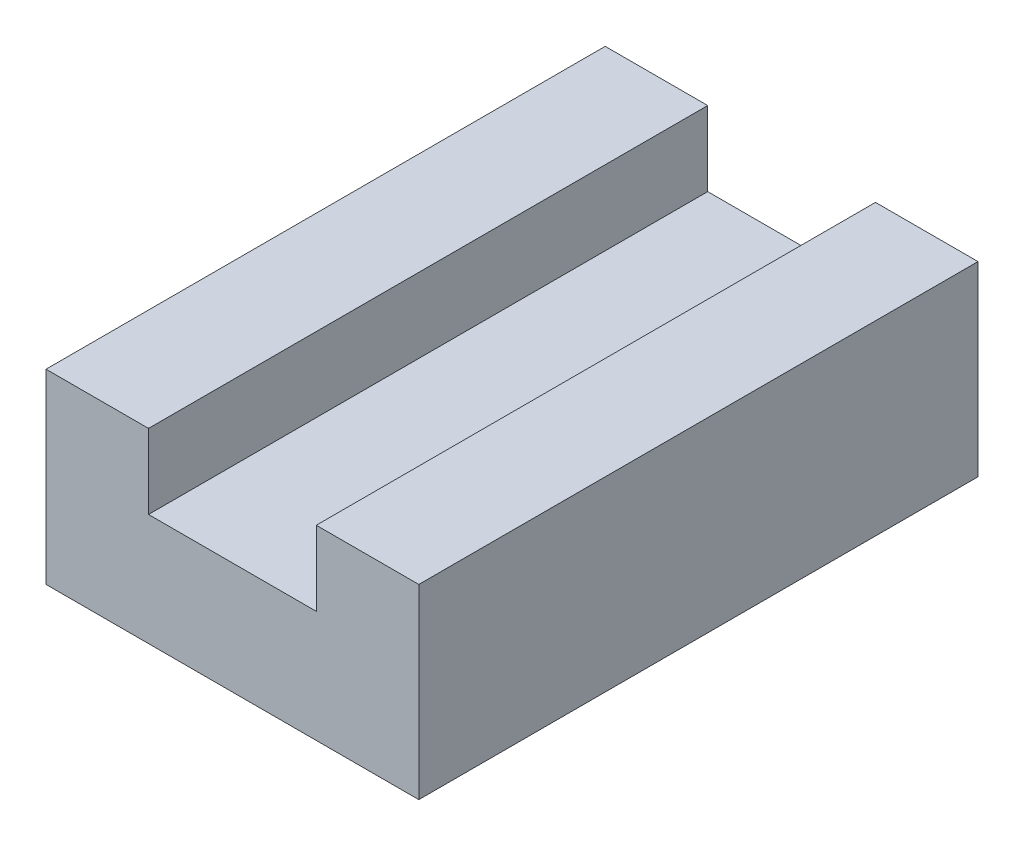
ISO-10303-21;
HEADER;
FILE_DESCRIPTION(('STEP AP214'),'2;1');
FILE_NAME('part.step','',(''),(''),'','','');
FILE_SCHEMA(('AUTOMOTIVE_DESIGN { 1 0 10303 214 1 1 1 1 }'));
ENDSEC;
DATA;
#1=APPLICATION_CONTEXT('core data for automotive mechanical design processes');
#2=APPLICATION_PROTOCOL_DEFINITION('international standard','automotive_design',2000,#1);
#3=PRODUCT_CONTEXT('',#1,'mechanical');
#4=PRODUCT('Part','Part','',(#3));
#5=PRODUCT_RELATED_PRODUCT_CATEGORY('part','',(#4));
#6=PRODUCT_DEFINITION_FORMATION('','',#4);
#7=PRODUCT_DEFINITION_CONTEXT('part definition',#1,'design');
#8=PRODUCT_DEFINITION('design','',#6,#7);
#9=PRODUCT_DEFINITION_SHAPE('','',#8);
#10=(LENGTH_UNIT() NAMED_UNIT(*) SI_UNIT(.MILLI.,.METRE.));
#11=(NAMED_UNIT(*) PLANE_ANGLE_UNIT() SI_UNIT($,.RADIAN.));
#12=(NAMED_UNIT(*) SI_UNIT($,.STERADIAN.) SOLID_ANGLE_UNIT());
#13=UNCERTAINTY_MEASURE_WITH_UNIT(LENGTH_MEASURE(1.E-05),#10,'distance_accuracy_value','');
#14=(GEOMETRIC_REPRESENTATION_CONTEXT(3) GLOBAL_UNCERTAINTY_ASSIGNED_CONTEXT((#13)) GLOBAL_UNIT_ASSIGNED_CONTEXT((#10,
#11,#12)) REPRESENTATION_CONTEXT('',''));
#15=CARTESIAN_POINT('',(0.,0.,0.));
#16=DIRECTION('',(0.,0.,1.));
#17=DIRECTION('',(1.,0.,0.));
#18=AXIS2_PLACEMENT_3D('',#15,#16,#17);
#19=CARTESIAN_POINT('',(0.,10.,0.));
#20=DIRECTION('',(0.,-1.,0.));
#21=DIRECTION('',(0.,0.,-1.));
#22=AXIS2_PLACEMENT_3D('',#19,#20,#21);
#23=PLANE('',#22);
#24=DIRECTION('',(1.,0.,0.));
#25=VECTOR('',#24,1.);
#26=CARTESIAN_POINT('',(0.,10.,0.));
#27=LINE('',#26,#25);
#28=CARTESIAN_POINT('',(0.,10.,0.));
#29=VERTEX_POINT('',#28);
#30=CARTESIAN_POINT('',(5.5,10.,0.));
#31=VERTEX_POINT('',#30);
#32=EDGE_CURVE('E87',#29,#31,#27,.T.);
#33=ORIENTED_EDGE('',*,*,#32,.T.);
#34=DIRECTION('',(0.,0.,1.));
#35=VECTOR('',#34,1.);
#36=CARTESIAN_POINT('',(5.5,10.,-30.));
#37=LINE('',#36,#35);
#38=CARTESIAN_POINT('',(5.5,10.,-30.));
#39=VERTEX_POINT('',#38);
#40=EDGE_CURVE('E139',#39,#31,#37,.T.);
#41=ORIENTED_EDGE('',*,*,#40,.F.);
#42=DIRECTION('',(-1.,0.,0.));
#43=VECTOR('',#42,1.);
#44=CARTESIAN_POINT('',(0.,10.,-30.));
#45=LINE('',#44,#43);
#46=CARTESIAN_POINT('',(0.,10.,-30.));
#47=VERTEX_POINT('',#46);
#48=EDGE_CURVE('E58',#39,#47,#45,.T.);
#49=ORIENTED_EDGE('',*,*,#48,.T.);
#50=DIRECTION('',(0.,0.,1.));
#51=VECTOR('',#50,1.);
#52=CARTESIAN_POINT('',(0.,10.,0.));
#53=LINE('',#52,#51);
#54=EDGE_CURVE('E145',#47,#29,#53,.T.);
#55=ORIENTED_EDGE('',*,*,#54,.T.);
#56=EDGE_LOOP('',(#33,#41,#49,#55));
#57=FACE_BOUND('',#56,.T.);
#58=ADVANCED_FACE('F34',(#57),#23,.F.);
#59=CARTESIAN_POINT('',(0.,10.,0.));
#60=DIRECTION('',(1.,0.,0.));
#61=DIRECTION('',(0.,0.,-1.));
#62=AXIS2_PLACEMENT_3D('',#59,#60,#61);
#63=PLANE('',#62);
#64=DIRECTION('',(0.,0.,1.));
#65=VECTOR('',#64,1.);
#66=CARTESIAN_POINT('',(0.,0.,0.));
#67=LINE('',#66,#65);
#68=CARTESIAN_POINT('',(0.,0.,-30.));
#69=VERTEX_POINT('',#68);
#70=CARTESIAN_POINT('',(0.,0.,0.));
#71=VERTEX_POINT('',#70);
#72=EDGE_CURVE('E141',#69,#71,#67,.T.);
#73=ORIENTED_EDGE('',*,*,#72,.T.);
#74=DIRECTION('',(0.,-1.,0.));
#75=VECTOR('',#74,1.);
#76=CARTESIAN_POINT('',(0.,10.,0.));
#77=LINE('',#76,#75);
#78=EDGE_CURVE('E11',#29,#71,#77,.T.);
#79=ORIENTED_EDGE('',*,*,#78,.F.);
#80=ORIENTED_EDGE('',*,*,#54,.F.);
#81=DIRECTION('',(0.,-1.,0.));
#82=VECTOR('',#81,1.);
#83=CARTESIAN_POINT('',(0.,10.,-30.));
#84=LINE('',#83,#82);
#85=EDGE_CURVE('E154',#47,#69,#84,.T.);
#86=ORIENTED_EDGE('',*,*,#85,.T.);
#87=EDGE_LOOP('',(#73,#79,#80,#86));
#88=FACE_BOUND('',#87,.T.);
#89=ADVANCED_FACE('F36',(#88),#63,.F.);
#90=CARTESIAN_POINT('',(0.,10.,0.));
#91=DIRECTION('',(0.,0.,-1.));
#92=DIRECTION('',(-1.,0.,0.));
#93=AXIS2_PLACEMENT_3D('',#90,#91,#92);
#94=PLANE('',#93);
#95=DIRECTION('',(1.,0.,0.));
#96=VECTOR('',#95,1.);
#97=CARTESIAN_POINT('',(5.5,6.,0.));
#98=LINE('',#97,#96);
#99=CARTESIAN_POINT('',(5.5,6.,0.));
#100=VERTEX_POINT('',#99);
#101=CARTESIAN_POINT('',(14.5,6.,0.));
#102=VERTEX_POINT('',#101);
#103=EDGE_CURVE('E129',#100,#102,#98,.T.);
#104=ORIENTED_EDGE('',*,*,#103,.F.);
#105=DIRECTION('',(0.,-1.,0.));
#106=VECTOR('',#105,1.);
#107=CARTESIAN_POINT('',(5.5,10.,0.));
#108=LINE('',#107,#106);
#109=EDGE_CURVE('E114',#31,#100,#108,.T.);
#110=ORIENTED_EDGE('',*,*,#109,.F.);
#111=ORIENTED_EDGE('',*,*,#32,.F.);
#112=ORIENTED_EDGE('',*,*,#78,.T.);
#113=DIRECTION('',(1.,0.,0.));
#114=VECTOR('',#113,1.);
#115=CARTESIAN_POINT('',(0.,0.,0.));
#116=LINE('',#115,#114);
#117=CARTESIAN_POINT('',(20.,0.,0.));
#118=VERTEX_POINT('',#117);
#119=EDGE_CURVE('E157',#71,#118,#116,.T.);
#120=ORIENTED_EDGE('',*,*,#119,.T.);
#121=DIRECTION('',(0.,-1.,0.));
#122=VECTOR('',#121,1.);
#123=CARTESIAN_POINT('',(20.,10.,0.));
#124=LINE('',#123,#122);
#125=CARTESIAN_POINT('',(20.,10.,0.));
#126=VERTEX_POINT('',#125);
#127=EDGE_CURVE('E42',#126,#118,#124,.T.);
#128=ORIENTED_EDGE('',*,*,#127,.F.);
#129=CARTESIAN_POINT('',(14.5,10.,0.));
#130=VERTEX_POINT('',#129);
#131=EDGE_CURVE('E147',#130,#126,#27,.T.);
#132=ORIENTED_EDGE('',*,*,#131,.F.);
#133=DIRECTION('',(0.,1.,0.));
#134=VECTOR('',#133,1.);
#135=CARTESIAN_POINT('',(14.5,10.,0.));
#136=LINE('',#135,#134);
#137=EDGE_CURVE('E49',#102,#130,#136,.T.);
#138=ORIENTED_EDGE('',*,*,#137,.F.);
#139=EDGE_LOOP('',(#104,#110,#111,#112,#120,#128,#132,#138));
#140=FACE_BOUND('',#139,.T.);
#141=ADVANCED_FACE('F178',(#140),#94,.F.);
#142=CARTESIAN_POINT('',(20.,10.,0.));
#143=DIRECTION('',(-1.,0.,0.));
#144=DIRECTION('',(0.,0.,1.));
#145=AXIS2_PLACEMENT_3D('',#142,#143,#144);
#146=PLANE('',#145);
#147=DIRECTION('',(0.,0.,-1.));
#148=VECTOR('',#147,1.);
#149=CARTESIAN_POINT('',(20.,0.,0.));
#150=LINE('',#149,#148);
#151=CARTESIAN_POINT('',(20.,0.,-30.));
#152=VERTEX_POINT('',#151);
#153=EDGE_CURVE('E159',#118,#152,#150,.T.);
#154=ORIENTED_EDGE('',*,*,#153,.T.);
#155=DIRECTION('',(0.,-1.,0.));
#156=VECTOR('',#155,1.);
#157=CARTESIAN_POINT('',(20.,10.,-30.));
#158=LINE('',#157,#156);
#159=CARTESIAN_POINT('',(20.,10.,-30.));
#160=VERTEX_POINT('',#159);
#161=EDGE_CURVE('E163',#160,#152,#158,.T.);
#162=ORIENTED_EDGE('',*,*,#161,.F.);
#163=DIRECTION('',(0.,0.,-1.));
#164=VECTOR('',#163,1.);
#165=CARTESIAN_POINT('',(20.,10.,0.));
#166=LINE('',#165,#164);
#167=EDGE_CURVE('E149',#126,#160,#166,.T.);
#168=ORIENTED_EDGE('',*,*,#167,.F.);
#169=ORIENTED_EDGE('',*,*,#127,.T.);
#170=EDGE_LOOP('',(#154,#162,#168,#169));
#171=FACE_BOUND('',#170,.T.);
#172=ADVANCED_FACE('F169',(#171),#146,.F.);
#173=CARTESIAN_POINT('',(0.,10.,-30.));
#174=DIRECTION('',(0.,0.,1.));
#175=DIRECTION('',(1.,0.,0.));
#176=AXIS2_PLACEMENT_3D('',#173,#174,#175);
#177=PLANE('',#176);
#178=ORIENTED_EDGE('',*,*,#48,.F.);
#179=DIRECTION('',(0.,-1.,0.));
#180=VECTOR('',#179,1.);
#181=CARTESIAN_POINT('',(5.5,10.,-30.));
#182=LINE('',#181,#180);
#183=CARTESIAN_POINT('',(5.5,6.,-30.));
#184=VERTEX_POINT('',#183);
#185=EDGE_CURVE('E113',#39,#184,#182,.T.);
#186=ORIENTED_EDGE('',*,*,#185,.T.);
#187=DIRECTION('',(1.,0.,0.));
#188=VECTOR('',#187,1.);
#189=CARTESIAN_POINT('',(5.5,6.,-30.));
#190=LINE('',#189,#188);
#191=CARTESIAN_POINT('',(14.5,6.,-30.));
#192=VERTEX_POINT('',#191);
#193=EDGE_CURVE('E122',#184,#192,#190,.T.);
#194=ORIENTED_EDGE('',*,*,#193,.T.);
#195=DIRECTION('',(0.,1.,0.));
#196=VECTOR('',#195,1.);
#197=CARTESIAN_POINT('',(14.5,10.,-30.));
#198=LINE('',#197,#196);
#199=CARTESIAN_POINT('',(14.5,10.,-30.));
#200=VERTEX_POINT('',#199);
#201=EDGE_CURVE('E119',#192,#200,#198,.T.);
#202=ORIENTED_EDGE('',*,*,#201,.T.);
#203=EDGE_CURVE('E151',#160,#200,#45,.T.);
#204=ORIENTED_EDGE('',*,*,#203,.F.);
#205=ORIENTED_EDGE('',*,*,#161,.T.);
#206=DIRECTION('',(-1.,0.,0.));
#207=VECTOR('',#206,1.);
#208=CARTESIAN_POINT('',(0.,0.,-30.));
#209=LINE('',#208,#207);
#210=EDGE_CURVE('E80',#152,#69,#209,.T.);
#211=ORIENTED_EDGE('',*,*,#210,.T.);
#212=ORIENTED_EDGE('',*,*,#85,.F.);
#213=EDGE_LOOP('',(#178,#186,#194,#202,#204,#205,#211,#212));
#214=FACE_BOUND('',#213,.T.);
#215=ADVANCED_FACE('F127',(#214),#177,.F.);
#216=ORIENTED_EDGE('',*,*,#203,.T.);
#217=DIRECTION('',(0.,0.,1.));
#218=VECTOR('',#217,1.);
#219=CARTESIAN_POINT('',(14.5,10.,-30.));
#220=LINE('',#219,#218);
#221=EDGE_CURVE('E142',#200,#130,#220,.T.);
#222=ORIENTED_EDGE('',*,*,#221,.T.);
#223=ORIENTED_EDGE('',*,*,#131,.T.);
#224=ORIENTED_EDGE('',*,*,#167,.T.);
#225=EDGE_LOOP('',(#216,#222,#223,#224));
#226=FACE_BOUND('',#225,.T.);
#227=ADVANCED_FACE('F180',(#226),#23,.F.);
#228=CARTESIAN_POINT('',(0.,0.,0.));
#229=DIRECTION('',(0.,-1.,0.));
#230=DIRECTION('',(0.,0.,-1.));
#231=AXIS2_PLACEMENT_3D('',#228,#229,#230);
#232=PLANE('',#231);
#233=CARTESIAN_POINT('',(2.5,0.,-9.6821205827078));
#234=DIRECTION('',(0.,-1.,0.));
#235=DIRECTION('',(0.,0.,-1.));
#236=AXIS2_PLACEMENT_3D('',#233,#234,#235);
#237=CIRCLE('',#236,1.5);
#238=CARTESIAN_POINT('',(2.5,0.,-11.1821205827078));
#239=VERTEX_POINT('',#238);
#240=EDGE_CURVE('E332',#239,#239,#237,.T.);
#241=ORIENTED_EDGE('',*,*,#240,.F.);
#242=EDGE_LOOP('',(#241));
#243=FACE_BOUND('',#242,.T.);
#244=CARTESIAN_POINT('',(17.5,0.,-9.6821205827078));
#245=DIRECTION('',(0.,-1.,0.));
#246=DIRECTION('',(0.,0.,-1.));
#247=AXIS2_PLACEMENT_3D('',#244,#245,#246);
#248=CIRCLE('',#247,1.5);
#249=CARTESIAN_POINT('',(17.5,0.,-11.1821205827078));
#250=VERTEX_POINT('',#249);
#251=EDGE_CURVE('E331',#250,#250,#248,.T.);
#252=ORIENTED_EDGE('',*,*,#251,.F.);
#253=EDGE_LOOP('',(#252));
#254=FACE_BOUND('',#253,.T.);
#255=CARTESIAN_POINT('',(17.5,0.,-19.6821205827078));
#256=DIRECTION('',(0.,-1.,0.));
#257=DIRECTION('',(0.,0.,-1.));
#258=AXIS2_PLACEMENT_3D('',#255,#256,#257);
#259=CIRCLE('',#258,1.5);
#260=CARTESIAN_POINT('',(17.5,0.,-21.1821205827078));
#261=VERTEX_POINT('',#260);
#262=EDGE_CURVE('E347',#261,#261,#259,.T.);
#263=ORIENTED_EDGE('',*,*,#262,.F.);
#264=EDGE_LOOP('',(#263));
#265=FACE_BOUND('',#264,.T.);
#266=CARTESIAN_POINT('',(2.5,0.,-19.6821205827078));
#267=DIRECTION('',(0.,-1.,0.));
#268=DIRECTION('',(0.,0.,-1.));
#269=AXIS2_PLACEMENT_3D('',#266,#267,#268);
#270=CIRCLE('',#269,1.5);
#271=CARTESIAN_POINT('',(2.5,0.,-21.1821205827078));
#272=VERTEX_POINT('',#271);
#273=EDGE_CURVE('E132',#272,#272,#270,.T.);
#274=ORIENTED_EDGE('',*,*,#273,.F.);
#275=EDGE_LOOP('',(#274));
#276=FACE_BOUND('',#275,.T.);
#277=ORIENTED_EDGE('',*,*,#72,.F.);
#278=ORIENTED_EDGE('',*,*,#210,.F.);
#279=ORIENTED_EDGE('',*,*,#153,.F.);
#280=ORIENTED_EDGE('',*,*,#119,.F.);
#281=EDGE_LOOP('',(#277,#278,#279,#280));
#282=FACE_BOUND('',#281,.T.);
#283=ADVANCED_FACE('F174',(#243,#254,#265,#276,#282),#232,.T.);
#284=CARTESIAN_POINT('',(5.5,10.,-30.));
#285=DIRECTION('',(-1.,0.,0.));
#286=DIRECTION('',(0.,0.,1.));
#287=AXIS2_PLACEMENT_3D('',#284,#285,#286);
#288=PLANE('',#287);
#289=ORIENTED_EDGE('',*,*,#109,.T.);
#290=DIRECTION('',(0.,0.,1.));
#291=VECTOR('',#290,1.);
#292=CARTESIAN_POINT('',(5.5,6.,-30.));
#293=LINE('',#292,#291);
#294=EDGE_CURVE('E109',#184,#100,#293,.T.);
#295=ORIENTED_EDGE('',*,*,#294,.F.);
#296=ORIENTED_EDGE('',*,*,#185,.F.);
#297=ORIENTED_EDGE('',*,*,#40,.T.);
#298=EDGE_LOOP('',(#289,#295,#296,#297));
#299=FACE_BOUND('',#298,.T.);
#300=ADVANCED_FACE('F111',(#299),#288,.F.);
#301=CARTESIAN_POINT('',(14.5,10.,-30.));
#302=DIRECTION('',(1.,0.,0.));
#303=DIRECTION('',(0.,1.,0.));
#304=AXIS2_PLACEMENT_3D('',#301,#302,#303);
#305=PLANE('',#304);
#306=ORIENTED_EDGE('',*,*,#137,.T.);
#307=ORIENTED_EDGE('',*,*,#221,.F.);
#308=ORIENTED_EDGE('',*,*,#201,.F.);
#309=DIRECTION('',(0.,0.,1.));
#310=VECTOR('',#309,1.);
#311=CARTESIAN_POINT('',(14.5,6.,-30.));
#312=LINE('',#311,#310);
#313=EDGE_CURVE('E118',#192,#102,#312,.T.);
#314=ORIENTED_EDGE('',*,*,#313,.T.);
#315=EDGE_LOOP('',(#306,#307,#308,#314));
#316=FACE_BOUND('',#315,.T.);
#317=ADVANCED_FACE('F182',(#316),#305,.F.);
#318=CARTESIAN_POINT('',(5.5,6.,-30.));
#319=DIRECTION('',(0.,-1.,0.));
#320=DIRECTION('',(1.,0.,0.));
#321=AXIS2_PLACEMENT_3D('',#318,#319,#320);
#322=PLANE('',#321);
#323=ORIENTED_EDGE('',*,*,#103,.T.);
#324=ORIENTED_EDGE('',*,*,#313,.F.);
#325=ORIENTED_EDGE('',*,*,#193,.F.);
#326=ORIENTED_EDGE('',*,*,#294,.T.);
#327=EDGE_LOOP('',(#323,#324,#325,#326));
#328=FACE_BOUND('',#327,.T.);
#329=ADVANCED_FACE('F123',(#328),#322,.F.);
#330=CARTESIAN_POINT('',(2.5,5.,-19.6821205827078));
#331=DIRECTION('',(0.,-1.,0.));
#332=DIRECTION('',(0.,0.,-1.));
#333=AXIS2_PLACEMENT_3D('',#330,#331,#332);
#334=CYLINDRICAL_SURFACE('',#333,1.5);
#335=CARTESIAN_POINT('',(2.5,5.,-19.6821205827078));
#336=DIRECTION('',(0.,-1.,0.));
#337=DIRECTION('',(0.,0.,-1.));
#338=AXIS2_PLACEMENT_3D('',#335,#336,#337);
#339=CIRCLE('',#338,1.5);
#340=CARTESIAN_POINT('',(2.5,5.,-21.1821205827078));
#341=VERTEX_POINT('',#340);
#342=EDGE_CURVE('E137',#341,#341,#339,.T.);
#343=ORIENTED_EDGE('',*,*,#342,.F.);
#344=EDGE_LOOP('',(#343));
#345=FACE_BOUND('',#344,.T.);
#346=ORIENTED_EDGE('',*,*,#273,.T.);
#347=EDGE_LOOP('',(#346));
#348=FACE_BOUND('',#347,.T.);
#349=ADVANCED_FACE('F189',(#345,#348),#334,.F.);
#350=CARTESIAN_POINT('',(2.5,5.,-19.6821205827078));
#351=DIRECTION('',(0.,-1.,0.));
#352=DIRECTION('',(0.,0.,-1.));
#353=AXIS2_PLACEMENT_3D('',#350,#351,#352);
#354=PLANE('',#353);
#355=ORIENTED_EDGE('',*,*,#342,.T.);
#356=EDGE_LOOP('',(#355));
#357=FACE_BOUND('',#356,.T.);
#358=ADVANCED_FACE('F255',(#357),#354,.T.);
#359=CARTESIAN_POINT('',(17.5,5.,-19.6821205827078));
#360=DIRECTION('',(0.,-1.,0.));
#361=DIRECTION('',(0.,0.,-1.));
#362=AXIS2_PLACEMENT_3D('',#359,#360,#361);
#363=CYLINDRICAL_SURFACE('',#362,1.5);
#364=CARTESIAN_POINT('',(17.5,5.,-19.6821205827078));
#365=DIRECTION('',(0.,-1.,0.));
#366=DIRECTION('',(0.,0.,-1.));
#367=AXIS2_PLACEMENT_3D('',#364,#365,#366);
#368=CIRCLE('',#367,1.5);
#369=CARTESIAN_POINT('',(17.5,5.,-21.1821205827078));
#370=VERTEX_POINT('',#369);
#371=EDGE_CURVE('E343',#370,#370,#368,.T.);
#372=ORIENTED_EDGE('',*,*,#371,.F.);
#373=EDGE_LOOP('',(#372));
#374=FACE_BOUND('',#373,.T.);
#375=ORIENTED_EDGE('',*,*,#262,.T.);
#376=EDGE_LOOP('',(#375));
#377=FACE_BOUND('',#376,.T.);
#378=ADVANCED_FACE('F263',(#374,#377),#363,.F.);
#379=CARTESIAN_POINT('',(17.5,5.,-19.6821205827078));
#380=DIRECTION('',(0.,-1.,0.));
#381=DIRECTION('',(0.,0.,-1.));
#382=AXIS2_PLACEMENT_3D('',#379,#380,#381);
#383=PLANE('',#382);
#384=ORIENTED_EDGE('',*,*,#371,.T.);
#385=EDGE_LOOP('',(#384));
#386=FACE_BOUND('',#385,.T.);
#387=ADVANCED_FACE('F272',(#386),#383,.T.);
#388=CARTESIAN_POINT('',(17.5,5.,-9.6821205827078));
#389=DIRECTION('',(0.,-1.,0.));
#390=DIRECTION('',(0.,0.,-1.));
#391=AXIS2_PLACEMENT_3D('',#388,#389,#390);
#392=CYLINDRICAL_SURFACE('',#391,1.5);
#393=CARTESIAN_POINT('',(17.5,5.,-9.6821205827078));
#394=DIRECTION('',(0.,-1.,0.));
#395=DIRECTION('',(0.,0.,-1.));
#396=AXIS2_PLACEMENT_3D('',#393,#394,#395);
#397=CIRCLE('',#396,1.5);
#398=CARTESIAN_POINT('',(17.5,5.,-11.1821205827078));
#399=VERTEX_POINT('',#398);
#400=EDGE_CURVE('E335',#399,#399,#397,.T.);
#401=ORIENTED_EDGE('',*,*,#400,.F.);
#402=EDGE_LOOP('',(#401));
#403=FACE_BOUND('',#402,.T.);
#404=ORIENTED_EDGE('',*,*,#251,.T.);
#405=EDGE_LOOP('',(#404));
#406=FACE_BOUND('',#405,.T.);
#407=ADVANCED_FACE('F281',(#403,#406),#392,.F.);
#408=CARTESIAN_POINT('',(17.5,5.,-9.6821205827078));
#409=DIRECTION('',(0.,-1.,0.));
#410=DIRECTION('',(0.,0.,-1.));
#411=AXIS2_PLACEMENT_3D('',#408,#409,#410);
#412=PLANE('',#411);
#413=ORIENTED_EDGE('',*,*,#400,.T.);
#414=EDGE_LOOP('',(#413));
#415=FACE_BOUND('',#414,.T.);
#416=ADVANCED_FACE('F290',(#415),#412,.T.);
#417=CARTESIAN_POINT('',(2.5,5.,-9.6821205827078));
#418=DIRECTION('',(0.,-1.,0.));
#419=DIRECTION('',(0.,0.,-1.));
#420=AXIS2_PLACEMENT_3D('',#417,#418,#419);
#421=CYLINDRICAL_SURFACE('',#420,1.5);
#422=CARTESIAN_POINT('',(2.5,5.,-9.6821205827078));
#423=DIRECTION('',(0.,-1.,0.));
#424=DIRECTION('',(0.,0.,-1.));
#425=AXIS2_PLACEMENT_3D('',#422,#423,#424);
#426=CIRCLE('',#425,1.5);
#427=CARTESIAN_POINT('',(2.5,5.,-11.1821205827078));
#428=VERTEX_POINT('',#427);
#429=EDGE_CURVE('E330',#428,#428,#426,.T.);
#430=ORIENTED_EDGE('',*,*,#429,.F.);
#431=EDGE_LOOP('',(#430));
#432=FACE_BOUND('',#431,.T.);
#433=ORIENTED_EDGE('',*,*,#240,.T.);
#434=EDGE_LOOP('',(#433));
#435=FACE_BOUND('',#434,.T.);
#436=ADVANCED_FACE('F299',(#432,#435),#421,.F.);
#437=CARTESIAN_POINT('',(2.5,5.,-9.6821205827078));
#438=DIRECTION('',(0.,-1.,0.));
#439=DIRECTION('',(0.,0.,-1.));
#440=AXIS2_PLACEMENT_3D('',#437,#438,#439);
#441=PLANE('',#440);
#442=ORIENTED_EDGE('',*,*,#429,.T.);
#443=EDGE_LOOP('',(#442));
#444=FACE_BOUND('',#443,.T.);
#445=ADVANCED_FACE('F308',(#444),#441,.T.);
#446=CLOSED_SHELL('',(#58,#89,#141,#172,#215,#227,#283,#300,#317,#329,#349,#358,#378,#387,#407,
#416,#436,#445));
#447=MANIFOLD_SOLID_BREP('B2',#446);
#448=ADVANCED_BREP_SHAPE_REPRESENTATION('',(#18,#447),#14);
#449=SHAPE_DEFINITION_REPRESENTATION(#9,#448);
ENDSEC;
END-ISO-10303-21;
